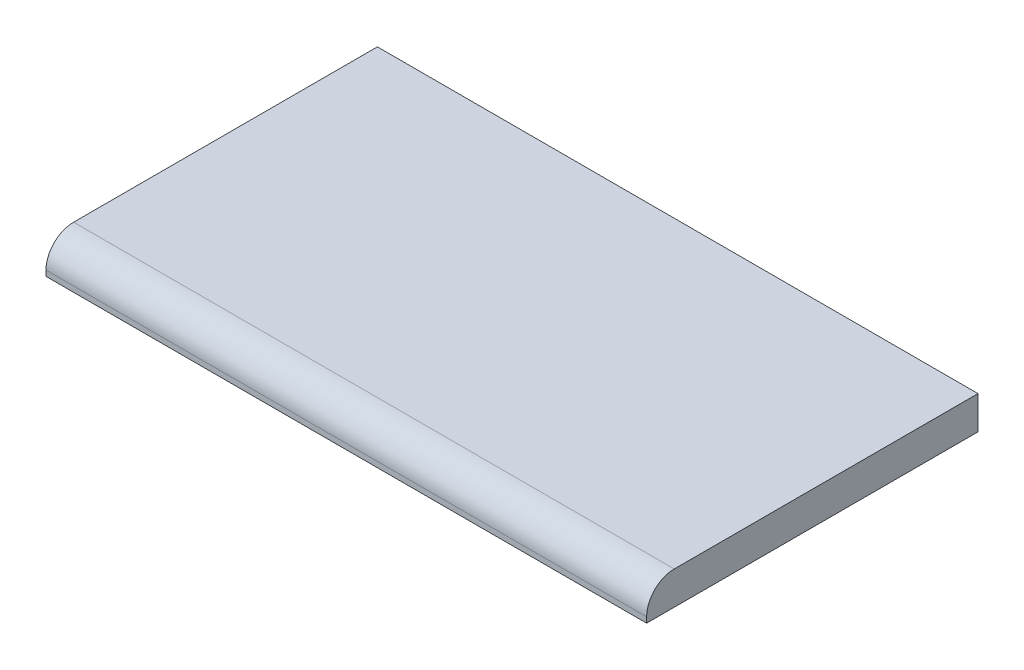
ISO-10303-21;
HEADER;
FILE_DESCRIPTION(('STEP AP214'),'2;1');
FILE_NAME('part.step','',(''),(''),'','','');
FILE_SCHEMA(('AUTOMOTIVE_DESIGN { 1 0 10303 214 1 1 1 1 }'));
ENDSEC;
DATA;
#1=APPLICATION_CONTEXT('core data for automotive mechanical design processes');
#2=APPLICATION_PROTOCOL_DEFINITION('international standard','automotive_design',2000,#1);
#3=PRODUCT_CONTEXT('',#1,'mechanical');
#4=PRODUCT('Part','Part','',(#3));
#5=PRODUCT_RELATED_PRODUCT_CATEGORY('part','',(#4));
#6=PRODUCT_DEFINITION_FORMATION('','',#4);
#7=PRODUCT_DEFINITION_CONTEXT('part definition',#1,'design');
#8=PRODUCT_DEFINITION('design','',#6,#7);
#9=PRODUCT_DEFINITION_SHAPE('','',#8);
#10=(LENGTH_UNIT() NAMED_UNIT(*) SI_UNIT(.MILLI.,.METRE.));
#11=(NAMED_UNIT(*) PLANE_ANGLE_UNIT() SI_UNIT($,.RADIAN.));
#12=(NAMED_UNIT(*) SI_UNIT($,.STERADIAN.) SOLID_ANGLE_UNIT());
#13=UNCERTAINTY_MEASURE_WITH_UNIT(LENGTH_MEASURE(1.E-05),#10,'distance_accuracy_value','');
#14=(GEOMETRIC_REPRESENTATION_CONTEXT(3) GLOBAL_UNCERTAINTY_ASSIGNED_CONTEXT((#13)) GLOBAL_UNIT_ASSIGNED_CONTEXT((#10,
#11,#12)) REPRESENTATION_CONTEXT('',''));
#15=CARTESIAN_POINT('',(0.,0.,0.));
#16=DIRECTION('',(0.,0.,1.));
#17=DIRECTION('',(1.,0.,0.));
#18=AXIS2_PLACEMENT_3D('',#15,#16,#17);
#19=CARTESIAN_POINT('',(0.,15.24,1.524));
#20=DIRECTION('',(0.,0.,-1.));
#21=DIRECTION('',(-1.,0.,0.));
#22=AXIS2_PLACEMENT_3D('',#19,#20,#21);
#23=PLANE('',#22);
#24=DIRECTION('',(0.,-1.,0.));
#25=VECTOR('',#24,1.);
#26=CARTESIAN_POINT('',(274.701,15.24,1.524));
#27=LINE('',#26,#25);
#28=CARTESIAN_POINT('',(274.701,2.54,1.524));
#29=VERTEX_POINT('',#28);
#30=CARTESIAN_POINT('',(274.701,0.,1.524));
#31=VERTEX_POINT('',#30);
#32=EDGE_CURVE('E256',#29,#31,#27,.T.);
#33=ORIENTED_EDGE('',*,*,#32,.F.);
#34=DIRECTION('',(1.,0.,0.));
#35=VECTOR('',#34,1.);
#36=CARTESIAN_POINT('',(-1.524,2.54,1.524));
#37=LINE('',#36,#35);
#38=CARTESIAN_POINT('',(-1.524,2.54,1.524));
#39=VERTEX_POINT('',#38);
#40=EDGE_CURVE('E56',#29,#39,#37,.F.);
#41=ORIENTED_EDGE('',*,*,#40,.T.);
#42=DIRECTION('',(0.,-1.,0.));
#43=VECTOR('',#42,1.);
#44=CARTESIAN_POINT('',(-1.524,15.24,1.524));
#45=LINE('',#44,#43);
#46=CARTESIAN_POINT('',(-1.524,0.,1.524));
#47=VERTEX_POINT('',#46);
#48=EDGE_CURVE('E231',#39,#47,#45,.T.);
#49=ORIENTED_EDGE('',*,*,#48,.T.);
#50=DIRECTION('',(1.,0.,0.));
#51=VECTOR('',#50,1.);
#52=CARTESIAN_POINT('',(0.,0.,1.524));
#53=LINE('',#52,#51);
#54=EDGE_CURVE('E206',#47,#31,#53,.T.);
#55=ORIENTED_EDGE('',*,*,#54,.T.);
#56=EDGE_LOOP('',(#33,#41,#49,#55));
#57=FACE_BOUND('',#56,.T.);
#58=ADVANCED_FACE('F47',(#57),#23,.F.);
#59=CARTESIAN_POINT('',(274.701,15.24,-1.00058850094342E-13));
#60=DIRECTION('',(-1.,0.,0.));
#61=DIRECTION('',(0.,0.,1.));
#62=AXIS2_PLACEMENT_3D('',#59,#60,#61);
#63=PLANE('',#62);
#64=DIRECTION('',(0.,0.,-1.));
#65=VECTOR('',#64,1.);
#66=CARTESIAN_POINT('',(274.701,15.24,-1.00058850094342E-13));
#67=LINE('',#66,#65);
#68=CARTESIAN_POINT('',(274.701,15.24,-11.176));
#69=VERTEX_POINT('',#68);
#70=CARTESIAN_POINT('',(274.701,15.24,-150.876));
#71=VERTEX_POINT('',#70);
#72=EDGE_CURVE('E220',#69,#71,#67,.T.);
#73=ORIENTED_EDGE('',*,*,#72,.F.);
#74=CARTESIAN_POINT('',(274.701,2.54,-11.176));
#75=DIRECTION('',(-1.,0.,0.));
#76=DIRECTION('',(0.,0.,1.));
#77=AXIS2_PLACEMENT_3D('',#74,#75,#76);
#78=CIRCLE('',#77,12.7);
#79=EDGE_CURVE('E263',#69,#29,#78,.F.);
#80=ORIENTED_EDGE('',*,*,#79,.T.);
#81=ORIENTED_EDGE('',*,*,#32,.T.);
#82=DIRECTION('',(0.,0.,-1.));
#83=VECTOR('',#82,1.);
#84=CARTESIAN_POINT('',(274.701,0.,-1.00058850094342E-13));
#85=LINE('',#84,#83);
#86=CARTESIAN_POINT('',(274.701,0.,-150.876));
#87=VERTEX_POINT('',#86);
#88=EDGE_CURVE('E235',#31,#87,#85,.T.);
#89=ORIENTED_EDGE('',*,*,#88,.T.);
#90=DIRECTION('',(0.,-1.,0.));
#91=VECTOR('',#90,1.);
#92=CARTESIAN_POINT('',(274.701,15.24,-150.876));
#93=LINE('',#92,#91);
#94=EDGE_CURVE('E252',#71,#87,#93,.T.);
#95=ORIENTED_EDGE('',*,*,#94,.F.);
#96=EDGE_LOOP('',(#73,#80,#81,#89,#95));
#97=FACE_BOUND('',#96,.T.);
#98=ADVANCED_FACE('F284',(#97),#63,.F.);
#99=CARTESIAN_POINT('',(0.,15.24,-150.876));
#100=DIRECTION('',(0.,0.,-1.));
#101=DIRECTION('',(-1.,0.,0.));
#102=AXIS2_PLACEMENT_3D('',#99,#100,#101);
#103=PLANE('',#102);
#104=DIRECTION('',(0.,-1.,0.));
#105=VECTOR('',#104,1.);
#106=CARTESIAN_POINT('',(187.3885,0.,-150.876));
#107=LINE('',#106,#105);
#108=CARTESIAN_POINT('',(187.3885,3.175,-150.876));
#109=VERTEX_POINT('',#108);
#110=CARTESIAN_POINT('',(187.3885,0.,-150.876));
#111=VERTEX_POINT('',#110);
#112=EDGE_CURVE('E153',#109,#111,#107,.T.);
#113=ORIENTED_EDGE('',*,*,#112,.F.);
#114=DIRECTION('',(-1.,0.,0.));
#115=VECTOR('',#114,1.);
#116=CARTESIAN_POINT('',(187.3885,3.175,-150.876));
#117=LINE('',#116,#115);
#118=CARTESIAN_POINT('',(85.7885,3.175,-150.876));
#119=VERTEX_POINT('',#118);
#120=EDGE_CURVE('E149',#109,#119,#117,.T.);
#121=ORIENTED_EDGE('',*,*,#120,.T.);
#122=DIRECTION('',(0.,-1.,0.));
#123=VECTOR('',#122,1.);
#124=CARTESIAN_POINT('',(85.7885,0.,-150.876));
#125=LINE('',#124,#123);
#126=CARTESIAN_POINT('',(85.7885,0.,-150.876));
#127=VERTEX_POINT('',#126);
#128=EDGE_CURVE('E292',#119,#127,#125,.T.);
#129=ORIENTED_EDGE('',*,*,#128,.T.);
#130=DIRECTION('',(1.,0.,0.));
#131=VECTOR('',#130,1.);
#132=CARTESIAN_POINT('',(0.,0.,-150.876));
#133=LINE('',#132,#131);
#134=CARTESIAN_POINT('',(-1.524,0.,-150.876));
#135=VERTEX_POINT('',#134);
#136=EDGE_CURVE('E240',#135,#127,#133,.T.);
#137=ORIENTED_EDGE('',*,*,#136,.F.);
#138=DIRECTION('',(0.,-1.,0.));
#139=VECTOR('',#138,1.);
#140=CARTESIAN_POINT('',(-1.524,15.24,-150.876));
#141=LINE('',#140,#139);
#142=CARTESIAN_POINT('',(-1.524,15.24,-150.876));
#143=VERTEX_POINT('',#142);
#144=EDGE_CURVE('E249',#143,#135,#141,.T.);
#145=ORIENTED_EDGE('',*,*,#144,.F.);
#146=DIRECTION('',(1.,0.,0.));
#147=VECTOR('',#146,1.);
#148=CARTESIAN_POINT('',(0.,15.24,-150.876));
#149=LINE('',#148,#147);
#150=EDGE_CURVE('E223',#143,#71,#149,.T.);
#151=ORIENTED_EDGE('',*,*,#150,.T.);
#152=ORIENTED_EDGE('',*,*,#94,.T.);
#153=EDGE_CURVE('E239',#111,#87,#133,.T.);
#154=ORIENTED_EDGE('',*,*,#153,.F.);
#155=EDGE_LOOP('',(#113,#121,#129,#137,#145,#151,#152,#154));
#156=FACE_BOUND('',#155,.T.);
#157=ADVANCED_FACE('F288',(#156),#103,.T.);
#158=CARTESIAN_POINT('',(-1.524,15.24,0.));
#159=DIRECTION('',(-1.,0.,0.));
#160=DIRECTION('',(0.,0.,1.));
#161=AXIS2_PLACEMENT_3D('',#158,#159,#160);
#162=PLANE('',#161);
#163=ORIENTED_EDGE('',*,*,#48,.F.);
#164=CARTESIAN_POINT('',(-1.524,2.54,-11.176));
#165=DIRECTION('',(-1.,0.,0.));
#166=DIRECTION('',(0.,0.,1.));
#167=AXIS2_PLACEMENT_3D('',#164,#165,#166);
#168=CIRCLE('',#167,12.7);
#169=CARTESIAN_POINT('',(-1.524,15.24,-11.176));
#170=VERTEX_POINT('',#169);
#171=EDGE_CURVE('E11',#39,#170,#168,.T.);
#172=ORIENTED_EDGE('',*,*,#171,.T.);
#173=DIRECTION('',(0.,0.,-1.));
#174=VECTOR('',#173,1.);
#175=CARTESIAN_POINT('',(-1.524,15.24,0.));
#176=LINE('',#175,#174);
#177=EDGE_CURVE('E228',#170,#143,#176,.T.);
#178=ORIENTED_EDGE('',*,*,#177,.T.);
#179=ORIENTED_EDGE('',*,*,#144,.T.);
#180=DIRECTION('',(0.,0.,-1.));
#181=VECTOR('',#180,1.);
#182=CARTESIAN_POINT('',(-1.524,0.,0.));
#183=LINE('',#182,#181);
#184=EDGE_CURVE('E224',#47,#135,#183,.T.);
#185=ORIENTED_EDGE('',*,*,#184,.F.);
#186=EDGE_LOOP('',(#163,#172,#178,#179,#185));
#187=FACE_BOUND('',#186,.T.);
#188=ADVANCED_FACE('F275',(#187),#162,.T.);
#189=CARTESIAN_POINT('',(0.,15.24,0.));
#190=DIRECTION('',(0.,1.,0.));
#191=DIRECTION('',(0.,0.,1.));
#192=AXIS2_PLACEMENT_3D('',#189,#190,#191);
#193=PLANE('',#192);
#194=ORIENTED_EDGE('',*,*,#177,.F.);
#195=DIRECTION('',(1.,0.,0.));
#196=VECTOR('',#195,1.);
#197=CARTESIAN_POINT('',(274.701,15.24,-11.176));
#198=LINE('',#197,#196);
#199=EDGE_CURVE('E259',#170,#69,#198,.T.);
#200=ORIENTED_EDGE('',*,*,#199,.T.);
#201=ORIENTED_EDGE('',*,*,#72,.T.);
#202=ORIENTED_EDGE('',*,*,#150,.F.);
#203=EDGE_LOOP('',(#194,#200,#201,#202));
#204=FACE_BOUND('',#203,.T.);
#205=ADVANCED_FACE('F280',(#204),#193,.T.);
#206=CARTESIAN_POINT('',(0.,0.,0.));
#207=DIRECTION('',(0.,1.,0.));
#208=DIRECTION('',(0.,0.,1.));
#209=AXIS2_PLACEMENT_3D('',#206,#207,#208);
#210=PLANE('',#209);
#211=DIRECTION('',(0.,0.,-1.));
#212=VECTOR('',#211,1.);
#213=CARTESIAN_POINT('',(0.,0.,0.));
#214=LINE('',#213,#212);
#215=CARTESIAN_POINT('',(0.,0.,0.));
#216=VERTEX_POINT('',#215);
#217=CARTESIAN_POINT('',(0.,0.,-149.352));
#218=VERTEX_POINT('',#217);
#219=EDGE_CURVE('E194',#216,#218,#214,.T.);
#220=ORIENTED_EDGE('',*,*,#219,.F.);
#221=DIRECTION('',(1.,0.,0.));
#222=VECTOR('',#221,1.);
#223=CARTESIAN_POINT('',(0.,0.,0.));
#224=LINE('',#223,#222);
#225=CARTESIAN_POINT('',(273.177,0.,0.));
#226=VERTEX_POINT('',#225);
#227=EDGE_CURVE('E164',#216,#226,#224,.T.);
#228=ORIENTED_EDGE('',*,*,#227,.T.);
#229=DIRECTION('',(0.,0.,-1.));
#230=VECTOR('',#229,1.);
#231=CARTESIAN_POINT('',(273.177,0.,0.));
#232=LINE('',#231,#230);
#233=CARTESIAN_POINT('',(273.177,0.,-149.352));
#234=VERTEX_POINT('',#233);
#235=EDGE_CURVE('E169',#226,#234,#232,.T.);
#236=ORIENTED_EDGE('',*,*,#235,.T.);
#237=DIRECTION('',(1.,0.,0.));
#238=VECTOR('',#237,1.);
#239=CARTESIAN_POINT('',(0.,0.,-149.352));
#240=LINE('',#239,#238);
#241=EDGE_CURVE('E71',#218,#234,#240,.T.);
#242=ORIENTED_EDGE('',*,*,#241,.F.);
#243=EDGE_LOOP('',(#220,#228,#236,#242));
#244=FACE_BOUND('',#243,.T.);
#245=ORIENTED_EDGE('',*,*,#54,.F.);
#246=ORIENTED_EDGE('',*,*,#184,.T.);
#247=ORIENTED_EDGE('',*,*,#136,.T.);
#248=DIRECTION('',(-1.,0.,0.));
#249=VECTOR('',#248,1.);
#250=CARTESIAN_POINT('',(187.3885,0.,-150.876));
#251=LINE('',#250,#249);
#252=EDGE_CURVE('E171',#111,#127,#251,.T.);
#253=ORIENTED_EDGE('',*,*,#252,.F.);
#254=ORIENTED_EDGE('',*,*,#153,.T.);
#255=ORIENTED_EDGE('',*,*,#88,.F.);
#256=EDGE_LOOP('',(#245,#246,#247,#253,#254,#255));
#257=FACE_BOUND('',#256,.T.);
#258=ADVANCED_FACE('F295',(#244,#257),#210,.F.);
#259=CARTESIAN_POINT('',(0.,2.54,-11.176));
#260=DIRECTION('',(-1.,0.,0.));
#261=DIRECTION('',(0.,0.,1.));
#262=AXIS2_PLACEMENT_3D('',#259,#260,#261);
#263=CYLINDRICAL_SURFACE('',#262,12.7);
#264=ORIENTED_EDGE('',*,*,#171,.F.);
#265=ORIENTED_EDGE('',*,*,#40,.F.);
#266=ORIENTED_EDGE('',*,*,#79,.F.);
#267=ORIENTED_EDGE('',*,*,#199,.F.);
#268=EDGE_LOOP('',(#264,#265,#266,#267));
#269=FACE_BOUND('',#268,.T.);
#270=ADVANCED_FACE('F49',(#269),#263,.T.);
#271=CARTESIAN_POINT('',(0.,15.24,0.));
#272=DIRECTION('',(0.,0.,-1.));
#273=DIRECTION('',(-1.,0.,0.));
#274=AXIS2_PLACEMENT_3D('',#271,#272,#273);
#275=PLANE('',#274);
#276=DIRECTION('',(0.,-1.,0.));
#277=VECTOR('',#276,1.);
#278=CARTESIAN_POINT('',(273.177,15.24,0.));
#279=LINE('',#278,#277);
#280=CARTESIAN_POINT('',(273.177,2.54000000000001,0.));
#281=VERTEX_POINT('',#280);
#282=EDGE_CURVE('E175',#281,#226,#279,.T.);
#283=ORIENTED_EDGE('',*,*,#282,.T.);
#284=ORIENTED_EDGE('',*,*,#227,.F.);
#285=DIRECTION('',(0.,-1.,0.));
#286=VECTOR('',#285,1.);
#287=CARTESIAN_POINT('',(0.,15.24,0.));
#288=LINE('',#287,#286);
#289=CARTESIAN_POINT('',(0.,2.54000000000001,0.));
#290=VERTEX_POINT('',#289);
#291=EDGE_CURVE('E185',#290,#216,#288,.T.);
#292=ORIENTED_EDGE('',*,*,#291,.F.);
#293=DIRECTION('',(-1.,0.,0.));
#294=VECTOR('',#293,1.);
#295=CARTESIAN_POINT('',(0.,2.54000000000001,0.));
#296=LINE('',#295,#294);
#297=EDGE_CURVE('E180',#281,#290,#296,.T.);
#298=ORIENTED_EDGE('',*,*,#297,.F.);
#299=EDGE_LOOP('',(#283,#284,#292,#298));
#300=FACE_BOUND('',#299,.T.);
#301=ADVANCED_FACE('F362',(#300),#275,.T.);
#302=CARTESIAN_POINT('',(273.177,15.24,0.));
#303=DIRECTION('',(-1.,0.,0.));
#304=DIRECTION('',(0.,0.,1.));
#305=AXIS2_PLACEMENT_3D('',#302,#303,#304);
#306=PLANE('',#305);
#307=DIRECTION('',(0.,0.,-1.));
#308=VECTOR('',#307,1.);
#309=CARTESIAN_POINT('',(273.177,13.716,0.));
#310=LINE('',#309,#308);
#311=CARTESIAN_POINT('',(273.177,13.716,-11.176));
#312=VERTEX_POINT('',#311);
#313=CARTESIAN_POINT('',(273.177,13.716,-149.352));
#314=VERTEX_POINT('',#313);
#315=EDGE_CURVE('E190',#312,#314,#310,.T.);
#316=ORIENTED_EDGE('',*,*,#315,.T.);
#317=DIRECTION('',(0.,-1.,0.));
#318=VECTOR('',#317,1.);
#319=CARTESIAN_POINT('',(273.177,15.24,-149.352));
#320=LINE('',#319,#318);
#321=EDGE_CURVE('E179',#314,#234,#320,.T.);
#322=ORIENTED_EDGE('',*,*,#321,.T.);
#323=ORIENTED_EDGE('',*,*,#235,.F.);
#324=ORIENTED_EDGE('',*,*,#282,.F.);
#325=CARTESIAN_POINT('',(273.177,2.54,-11.176));
#326=DIRECTION('',(-1.,0.,0.));
#327=DIRECTION('',(0.,0.,1.));
#328=AXIS2_PLACEMENT_3D('',#325,#326,#327);
#329=CIRCLE('',#328,11.176);
#330=EDGE_CURVE('E184',#312,#281,#329,.F.);
#331=ORIENTED_EDGE('',*,*,#330,.F.);
#332=EDGE_LOOP('',(#316,#322,#323,#324,#331));
#333=FACE_BOUND('',#332,.T.);
#334=ADVANCED_FACE('F359',(#333),#306,.T.);
#335=CARTESIAN_POINT('',(0.,15.24,-149.352));
#336=DIRECTION('',(0.,0.,-1.));
#337=DIRECTION('',(-1.,0.,0.));
#338=AXIS2_PLACEMENT_3D('',#335,#336,#337);
#339=PLANE('',#338);
#340=ORIENTED_EDGE('',*,*,#241,.T.);
#341=ORIENTED_EDGE('',*,*,#321,.F.);
#342=DIRECTION('',(1.,0.,0.));
#343=VECTOR('',#342,1.);
#344=CARTESIAN_POINT('',(0.,13.716,-149.352));
#345=LINE('',#344,#343);
#346=CARTESIAN_POINT('',(0.,13.716,-149.352));
#347=VERTEX_POINT('',#346);
#348=EDGE_CURVE('E193',#347,#314,#345,.T.);
#349=ORIENTED_EDGE('',*,*,#348,.F.);
#350=DIRECTION('',(0.,-1.,0.));
#351=VECTOR('',#350,1.);
#352=CARTESIAN_POINT('',(0.,15.24,-149.352));
#353=LINE('',#352,#351);
#354=EDGE_CURVE('E188',#347,#218,#353,.T.);
#355=ORIENTED_EDGE('',*,*,#354,.T.);
#356=EDGE_LOOP('',(#340,#341,#349,#355));
#357=FACE_BOUND('',#356,.T.);
#358=ADVANCED_FACE('F355',(#357),#339,.F.);
#359=CARTESIAN_POINT('',(0.,15.24,0.));
#360=DIRECTION('',(-1.,0.,0.));
#361=DIRECTION('',(0.,0.,1.));
#362=AXIS2_PLACEMENT_3D('',#359,#360,#361);
#363=PLANE('',#362);
#364=ORIENTED_EDGE('',*,*,#291,.T.);
#365=ORIENTED_EDGE('',*,*,#219,.T.);
#366=ORIENTED_EDGE('',*,*,#354,.F.);
#367=DIRECTION('',(0.,0.,-1.));
#368=VECTOR('',#367,1.);
#369=CARTESIAN_POINT('',(0.,13.716,0.));
#370=LINE('',#369,#368);
#371=CARTESIAN_POINT('',(0.,13.716,-11.176));
#372=VERTEX_POINT('',#371);
#373=EDGE_CURVE('E189',#372,#347,#370,.T.);
#374=ORIENTED_EDGE('',*,*,#373,.F.);
#375=CARTESIAN_POINT('',(0.,2.54,-11.176));
#376=DIRECTION('',(-1.,0.,0.));
#377=DIRECTION('',(0.,0.,1.));
#378=AXIS2_PLACEMENT_3D('',#375,#376,#377);
#379=CIRCLE('',#378,11.176);
#380=EDGE_CURVE('E183',#290,#372,#379,.T.);
#381=ORIENTED_EDGE('',*,*,#380,.F.);
#382=EDGE_LOOP('',(#364,#365,#366,#374,#381));
#383=FACE_BOUND('',#382,.T.);
#384=ADVANCED_FACE('F351',(#383),#363,.F.);
#385=CARTESIAN_POINT('',(0.,13.716,0.));
#386=DIRECTION('',(0.,1.,0.));
#387=DIRECTION('',(0.,0.,1.));
#388=AXIS2_PLACEMENT_3D('',#385,#386,#387);
#389=PLANE('',#388);
#390=ORIENTED_EDGE('',*,*,#373,.T.);
#391=ORIENTED_EDGE('',*,*,#348,.T.);
#392=ORIENTED_EDGE('',*,*,#315,.F.);
#393=DIRECTION('',(1.,0.,0.));
#394=VECTOR('',#393,1.);
#395=CARTESIAN_POINT('',(0.,13.716,-11.176));
#396=LINE('',#395,#394);
#397=EDGE_CURVE('E178',#372,#312,#396,.T.);
#398=ORIENTED_EDGE('',*,*,#397,.F.);
#399=EDGE_LOOP('',(#390,#391,#392,#398));
#400=FACE_BOUND('',#399,.T.);
#401=ADVANCED_FACE('F347',(#400),#389,.F.);
#402=CARTESIAN_POINT('',(0.,2.54,-11.176));
#403=DIRECTION('',(-1.,0.,0.));
#404=DIRECTION('',(0.,0.,1.));
#405=AXIS2_PLACEMENT_3D('',#402,#403,#404);
#406=CYLINDRICAL_SURFACE('',#405,11.176);
#407=ORIENTED_EDGE('',*,*,#380,.T.);
#408=ORIENTED_EDGE('',*,*,#397,.T.);
#409=ORIENTED_EDGE('',*,*,#330,.T.);
#410=ORIENTED_EDGE('',*,*,#297,.T.);
#411=EDGE_LOOP('',(#407,#408,#409,#410));
#412=FACE_BOUND('',#411,.T.);
#413=ADVANCED_FACE('F344',(#412),#406,.F.);
#414=CARTESIAN_POINT('',(187.3885,0.,-154.051));
#415=DIRECTION('',(-1.,0.,0.));
#416=DIRECTION('',(0.,0.,1.));
#417=AXIS2_PLACEMENT_3D('',#414,#415,#416);
#418=CYLINDRICAL_SURFACE('',#417,3.175);
#419=CARTESIAN_POINT('',(85.7885,0.,-154.051));
#420=DIRECTION('',(1.,0.,0.));
#421=DIRECTION('',(0.,0.,-1.));
#422=AXIS2_PLACEMENT_3D('',#419,#420,#421);
#423=CIRCLE('',#422,3.175);
#424=CARTESIAN_POINT('',(85.7885,3.175,-154.051));
#425=VERTEX_POINT('',#424);
#426=EDGE_CURVE('E162',#127,#425,#423,.T.);
#427=ORIENTED_EDGE('',*,*,#426,.T.);
#428=DIRECTION('',(-1.,0.,0.));
#429=VECTOR('',#428,1.);
#430=CARTESIAN_POINT('',(187.3885,3.175,-154.051));
#431=LINE('',#430,#429);
#432=CARTESIAN_POINT('',(187.3885,3.175,-154.051));
#433=VERTEX_POINT('',#432);
#434=EDGE_CURVE('E146',#433,#425,#431,.T.);
#435=ORIENTED_EDGE('',*,*,#434,.F.);
#436=CARTESIAN_POINT('',(187.3885,0.,-154.051));
#437=DIRECTION('',(1.,0.,0.));
#438=DIRECTION('',(0.,0.,-1.));
#439=AXIS2_PLACEMENT_3D('',#436,#437,#438);
#440=CIRCLE('',#439,3.175);
#441=EDGE_CURVE('E63',#111,#433,#440,.T.);
#442=ORIENTED_EDGE('',*,*,#441,.F.);
#443=ORIENTED_EDGE('',*,*,#252,.T.);
#444=EDGE_LOOP('',(#427,#435,#442,#443));
#445=FACE_BOUND('',#444,.T.);
#446=ADVANCED_FACE('F160',(#445),#418,.T.);
#447=CARTESIAN_POINT('',(187.3885,3.17500000000008,0.));
#448=DIRECTION('',(0.,-1.,0.));
#449=DIRECTION('',(0.,0.,-1.));
#450=AXIS2_PLACEMENT_3D('',#447,#448,#449);
#451=PLANE('',#450);
#452=DIRECTION('',(0.,0.,1.));
#453=VECTOR('',#452,1.);
#454=CARTESIAN_POINT('',(85.7885,3.17500000000008,0.));
#455=LINE('',#454,#453);
#456=EDGE_CURVE('E307',#425,#119,#455,.T.);
#457=ORIENTED_EDGE('',*,*,#456,.T.);
#458=ORIENTED_EDGE('',*,*,#120,.F.);
#459=DIRECTION('',(0.,0.,1.));
#460=VECTOR('',#459,1.);
#461=CARTESIAN_POINT('',(187.3885,3.17500000000008,0.));
#462=LINE('',#461,#460);
#463=EDGE_CURVE('E144',#433,#109,#462,.T.);
#464=ORIENTED_EDGE('',*,*,#463,.F.);
#465=ORIENTED_EDGE('',*,*,#434,.T.);
#466=EDGE_LOOP('',(#457,#458,#464,#465));
#467=FACE_BOUND('',#466,.T.);
#468=ADVANCED_FACE('F145',(#467),#451,.F.);
#469=CARTESIAN_POINT('',(187.3885,0.,-154.051));
#470=DIRECTION('',(-1.,0.,0.));
#471=DIRECTION('',(0.,0.,1.));
#472=AXIS2_PLACEMENT_3D('',#469,#470,#471);
#473=CYLINDRICAL_SURFACE('',#472,1.65100000000002);
#474=CARTESIAN_POINT('',(187.3885,0.,-154.051));
#475=DIRECTION('',(1.,0.,0.));
#476=DIRECTION('',(0.,0.,-1.));
#477=AXIS2_PLACEMENT_3D('',#474,#475,#476);
#478=CIRCLE('',#477,1.65100000000002);
#479=CARTESIAN_POINT('',(187.3885,0.,-155.702));
#480=VERTEX_POINT('',#479);
#481=EDGE_CURVE('E158',#480,#480,#478,.T.);
#482=ORIENTED_EDGE('',*,*,#481,.T.);
#483=EDGE_LOOP('',(#482));
#484=FACE_BOUND('',#483,.T.);
#485=CARTESIAN_POINT('',(85.7885,0.,-154.051));
#486=DIRECTION('',(1.,0.,0.));
#487=DIRECTION('',(0.,0.,-1.));
#488=AXIS2_PLACEMENT_3D('',#485,#486,#487);
#489=CIRCLE('',#488,1.65100000000002);
#490=CARTESIAN_POINT('',(85.7885,0.,-155.702));
#491=VERTEX_POINT('',#490);
#492=EDGE_CURVE('E301',#491,#491,#489,.T.);
#493=ORIENTED_EDGE('',*,*,#492,.F.);
#494=EDGE_LOOP('',(#493));
#495=FACE_BOUND('',#494,.T.);
#496=ADVANCED_FACE('F316',(#484,#495),#473,.F.);
#497=CARTESIAN_POINT('',(187.3885,0.,0.));
#498=DIRECTION('',(1.,0.,0.));
#499=DIRECTION('',(0.,0.,-1.));
#500=AXIS2_PLACEMENT_3D('',#497,#498,#499);
#501=PLANE('',#500);
#502=ORIENTED_EDGE('',*,*,#481,.F.);
#503=EDGE_LOOP('',(#502));
#504=FACE_BOUND('',#503,.T.);
#505=ORIENTED_EDGE('',*,*,#441,.T.);
#506=ORIENTED_EDGE('',*,*,#463,.T.);
#507=ORIENTED_EDGE('',*,*,#112,.T.);
#508=EDGE_LOOP('',(#505,#506,#507));
#509=FACE_BOUND('',#508,.T.);
#510=ADVANCED_FACE('F155',(#504,#509),#501,.T.);
#511=CARTESIAN_POINT('',(85.7885,0.,0.));
#512=DIRECTION('',(1.,0.,0.));
#513=DIRECTION('',(0.,0.,-1.));
#514=AXIS2_PLACEMENT_3D('',#511,#512,#513);
#515=PLANE('',#514);
#516=ORIENTED_EDGE('',*,*,#492,.T.);
#517=EDGE_LOOP('',(#516));
#518=FACE_BOUND('',#517,.T.);
#519=ORIENTED_EDGE('',*,*,#426,.F.);
#520=ORIENTED_EDGE('',*,*,#128,.F.);
#521=ORIENTED_EDGE('',*,*,#456,.F.);
#522=EDGE_LOOP('',(#519,#520,#521));
#523=FACE_BOUND('',#522,.T.);
#524=ADVANCED_FACE('F320',(#518,#523),#515,.F.);
#525=CLOSED_SHELL('',(#58,#98,#157,#188,#205,#258,#270,#301,#334,#358,#384,#401,#413,#446,#468,
#496,#510,#524));
#526=MANIFOLD_SOLID_BREP('B2',#525);
#527=ADVANCED_BREP_SHAPE_REPRESENTATION('',(#18,#526),#14);
#528=SHAPE_DEFINITION_REPRESENTATION(#9,#527);
ENDSEC;
END-ISO-10303-21;
